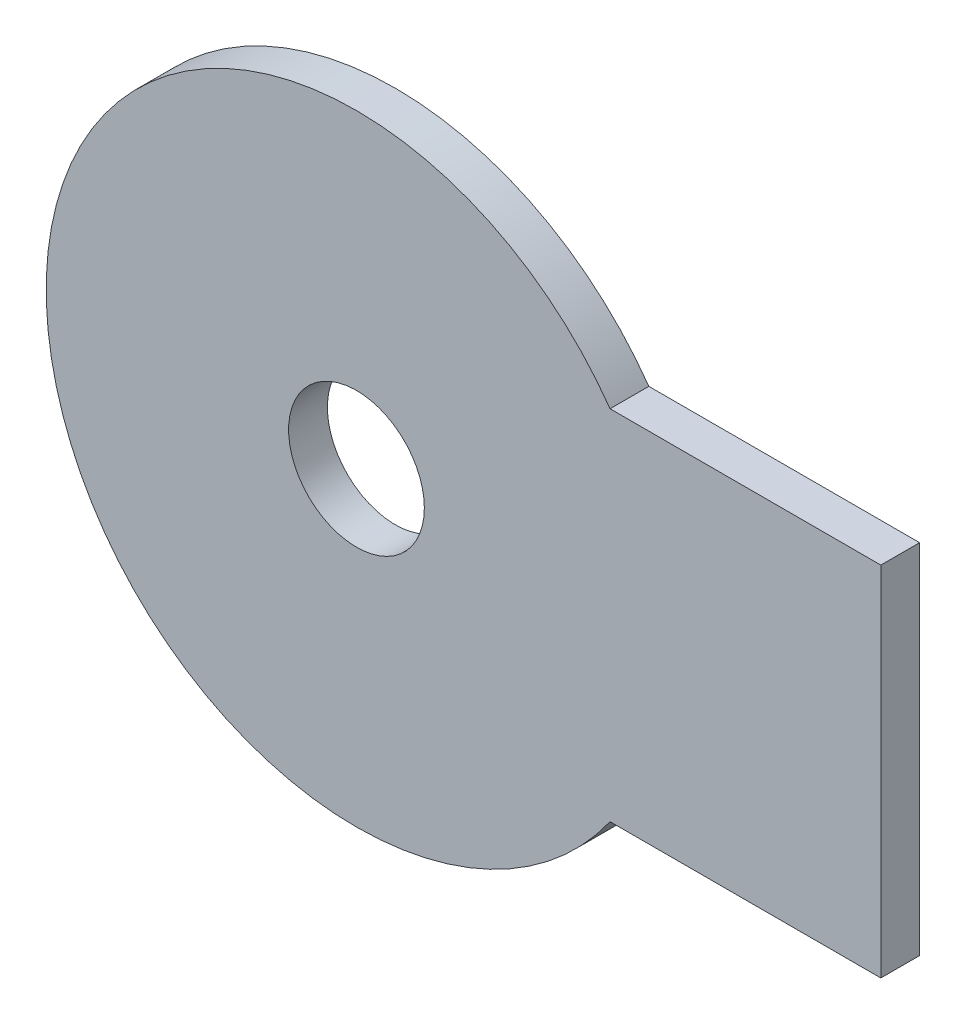
ISO-10303-21;
HEADER;
FILE_DESCRIPTION(('STEP AP214'),'2;1');
FILE_NAME('part.step','',(''),(''),'','','');
FILE_SCHEMA(('AUTOMOTIVE_DESIGN { 1 0 10303 214 1 1 1 1 }'));
ENDSEC;
DATA;
#1=APPLICATION_CONTEXT('core data for automotive mechanical design processes');
#2=APPLICATION_PROTOCOL_DEFINITION('international standard','automotive_design',2000,#1);
#3=PRODUCT_CONTEXT('',#1,'mechanical');
#4=PRODUCT('Part','Part','',(#3));
#5=PRODUCT_RELATED_PRODUCT_CATEGORY('part','',(#4));
#6=PRODUCT_DEFINITION_FORMATION('','',#4);
#7=PRODUCT_DEFINITION_CONTEXT('part definition',#1,'design');
#8=PRODUCT_DEFINITION('design','',#6,#7);
#9=PRODUCT_DEFINITION_SHAPE('','',#8);
#10=(LENGTH_UNIT() NAMED_UNIT(*) SI_UNIT(.MILLI.,.METRE.));
#11=(NAMED_UNIT(*) PLANE_ANGLE_UNIT() SI_UNIT($,.RADIAN.));
#12=(NAMED_UNIT(*) SI_UNIT($,.STERADIAN.) SOLID_ANGLE_UNIT());
#13=UNCERTAINTY_MEASURE_WITH_UNIT(LENGTH_MEASURE(1.E-05),#10,'distance_accuracy_value','');
#14=(GEOMETRIC_REPRESENTATION_CONTEXT(3) GLOBAL_UNCERTAINTY_ASSIGNED_CONTEXT((#13)) GLOBAL_UNIT_ASSIGNED_CONTEXT((#10,
#11,#12)) REPRESENTATION_CONTEXT('',''));
#15=CARTESIAN_POINT('',(0.,0.,0.));
#16=DIRECTION('',(0.,0.,1.));
#17=DIRECTION('',(1.,0.,0.));
#18=AXIS2_PLACEMENT_3D('',#15,#16,#17);
#19=CARTESIAN_POINT('',(0.,0.,12.7));
#20=DIRECTION('',(0.,0.,-1.));
#21=DIRECTION('',(-1.,0.,0.));
#22=AXIS2_PLACEMENT_3D('',#19,#20,#21);
#23=CYLINDRICAL_SURFACE('',#22,101.6);
#24=CARTESIAN_POINT('',(0.,0.,0.));
#25=DIRECTION('',(0.,0.,1.));
#26=DIRECTION('',(1.,0.,0.));
#27=AXIS2_PLACEMENT_3D('',#24,#25,#26);
#28=CIRCLE('',#27,101.6);
#29=CARTESIAN_POINT('',(83.0340445421274,58.5483342801143,0.));
#30=VERTEX_POINT('',#29);
#31=CARTESIAN_POINT('',(83.0340445421274,-58.5483342801143,0.));
#32=VERTEX_POINT('',#31);
#33=EDGE_CURVE('E101',#30,#32,#28,.T.);
#34=ORIENTED_EDGE('',*,*,#33,.T.);
#35=DIRECTION('',(0.,0.,-1.));
#36=VECTOR('',#35,1.);
#37=CARTESIAN_POINT('',(83.0340445421274,-58.5483342801143,12.7));
#38=LINE('',#37,#36);
#39=CARTESIAN_POINT('',(83.0340445421274,-58.5483342801143,12.7));
#40=VERTEX_POINT('',#39);
#41=EDGE_CURVE('E11',#40,#32,#38,.T.);
#42=ORIENTED_EDGE('',*,*,#41,.F.);
#43=CARTESIAN_POINT('',(0.,0.,12.7));
#44=DIRECTION('',(0.,0.,1.));
#45=DIRECTION('',(1.,0.,0.));
#46=AXIS2_PLACEMENT_3D('',#43,#44,#45);
#47=CIRCLE('',#46,101.6);
#48=CARTESIAN_POINT('',(83.0340445421274,58.5483342801143,12.7));
#49=VERTEX_POINT('',#48);
#50=EDGE_CURVE('E75',#49,#40,#47,.T.);
#51=ORIENTED_EDGE('',*,*,#50,.F.);
#52=DIRECTION('',(0.,0.,-1.));
#53=VECTOR('',#52,1.);
#54=CARTESIAN_POINT('',(83.0340445421274,58.5483342801143,12.7));
#55=LINE('',#54,#53);
#56=EDGE_CURVE('E94',#49,#30,#55,.T.);
#57=ORIENTED_EDGE('',*,*,#56,.T.);
#58=EDGE_LOOP('',(#34,#42,#51,#57));
#59=FACE_BOUND('',#58,.T.);
#60=ADVANCED_FACE('F35',(#59),#23,.T.);
#61=CARTESIAN_POINT('',(0.,-58.5483342801143,12.7));
#62=DIRECTION('',(0.,-1.,0.));
#63=DIRECTION('',(0.,0.,-1.));
#64=AXIS2_PLACEMENT_3D('',#61,#62,#63);
#65=PLANE('',#64);
#66=DIRECTION('',(-1.,0.,0.));
#67=VECTOR('',#66,1.);
#68=CARTESIAN_POINT('',(0.,-58.5483342801143,0.));
#69=LINE('',#68,#67);
#70=CARTESIAN_POINT('',(171.693555001292,-58.5483342801143,0.));
#71=VERTEX_POINT('',#70);
#72=EDGE_CURVE('E84',#71,#32,#69,.T.);
#73=ORIENTED_EDGE('',*,*,#72,.F.);
#74=DIRECTION('',(0.,0.,-1.));
#75=VECTOR('',#74,1.);
#76=CARTESIAN_POINT('',(171.693555001292,-58.5483342801143,12.7));
#77=LINE('',#76,#75);
#78=CARTESIAN_POINT('',(171.693555001292,-58.5483342801143,12.7));
#79=VERTEX_POINT('',#78);
#80=EDGE_CURVE('E44',#79,#71,#77,.T.);
#81=ORIENTED_EDGE('',*,*,#80,.F.);
#82=DIRECTION('',(-1.,0.,0.));
#83=VECTOR('',#82,1.);
#84=CARTESIAN_POINT('',(0.,-58.5483342801143,12.7));
#85=LINE('',#84,#83);
#86=EDGE_CURVE('E82',#79,#40,#85,.T.);
#87=ORIENTED_EDGE('',*,*,#86,.T.);
#88=ORIENTED_EDGE('',*,*,#41,.T.);
#89=EDGE_LOOP('',(#73,#81,#87,#88));
#90=FACE_BOUND('',#89,.T.);
#91=ADVANCED_FACE('F81',(#90),#65,.T.);
#92=CARTESIAN_POINT('',(171.693555001292,0.,12.7));
#93=DIRECTION('',(1.,0.,0.));
#94=DIRECTION('',(0.,0.,-1.));
#95=AXIS2_PLACEMENT_3D('',#92,#93,#94);
#96=PLANE('',#95);
#97=DIRECTION('',(0.,-1.,0.));
#98=VECTOR('',#97,1.);
#99=CARTESIAN_POINT('',(171.693555001292,0.,0.));
#100=LINE('',#99,#98);
#101=CARTESIAN_POINT('',(171.693555001292,58.5483342801143,0.));
#102=VERTEX_POINT('',#101);
#103=EDGE_CURVE('E105',#102,#71,#100,.T.);
#104=ORIENTED_EDGE('',*,*,#103,.F.);
#105=DIRECTION('',(0.,0.,-1.));
#106=VECTOR('',#105,1.);
#107=CARTESIAN_POINT('',(171.693555001292,58.5483342801143,12.7));
#108=LINE('',#107,#106);
#109=CARTESIAN_POINT('',(171.693555001292,58.5483342801143,12.7));
#110=VERTEX_POINT('',#109);
#111=EDGE_CURVE('E67',#110,#102,#108,.T.);
#112=ORIENTED_EDGE('',*,*,#111,.F.);
#113=DIRECTION('',(0.,-1.,0.));
#114=VECTOR('',#113,1.);
#115=CARTESIAN_POINT('',(171.693555001292,0.,12.7));
#116=LINE('',#115,#114);
#117=EDGE_CURVE('E90',#110,#79,#116,.T.);
#118=ORIENTED_EDGE('',*,*,#117,.T.);
#119=ORIENTED_EDGE('',*,*,#80,.T.);
#120=EDGE_LOOP('',(#104,#112,#118,#119));
#121=FACE_BOUND('',#120,.T.);
#122=ADVANCED_FACE('F92',(#121),#96,.T.);
#123=CARTESIAN_POINT('',(0.,0.,12.7));
#124=DIRECTION('',(0.,0.,-1.));
#125=DIRECTION('',(-1.,0.,0.));
#126=AXIS2_PLACEMENT_3D('',#123,#124,#125);
#127=CYLINDRICAL_SURFACE('',#126,22.225);
#128=CARTESIAN_POINT('',(0.,0.,12.7));
#129=DIRECTION('',(0.,0.,1.));
#130=DIRECTION('',(1.,0.,0.));
#131=AXIS2_PLACEMENT_3D('',#128,#129,#130);
#132=CIRCLE('',#131,22.225);
#133=CARTESIAN_POINT('',(22.225,0.,12.7));
#134=VERTEX_POINT('',#133);
#135=EDGE_CURVE('E108',#134,#134,#132,.T.);
#136=ORIENTED_EDGE('',*,*,#135,.T.);
#137=EDGE_LOOP('',(#136));
#138=FACE_BOUND('',#137,.T.);
#139=CARTESIAN_POINT('',(0.,0.,0.));
#140=DIRECTION('',(0.,0.,1.));
#141=DIRECTION('',(1.,0.,0.));
#142=AXIS2_PLACEMENT_3D('',#139,#140,#141);
#143=CIRCLE('',#142,22.225);
#144=CARTESIAN_POINT('',(22.225,0.,0.));
#145=VERTEX_POINT('',#144);
#146=EDGE_CURVE('E98',#145,#145,#143,.T.);
#147=ORIENTED_EDGE('',*,*,#146,.F.);
#148=EDGE_LOOP('',(#147));
#149=FACE_BOUND('',#148,.T.);
#150=ADVANCED_FACE('F37',(#138,#149),#127,.F.);
#151=CARTESIAN_POINT('',(0.,58.5483342801143,12.7));
#152=DIRECTION('',(0.,-1.,0.));
#153=DIRECTION('',(1.,0.,0.));
#154=AXIS2_PLACEMENT_3D('',#151,#152,#153);
#155=PLANE('',#154);
#156=DIRECTION('',(-1.,0.,0.));
#157=VECTOR('',#156,1.);
#158=CARTESIAN_POINT('',(0.,58.5483342801143,0.));
#159=LINE('',#158,#157);
#160=EDGE_CURVE('E70',#102,#30,#159,.T.);
#161=ORIENTED_EDGE('',*,*,#160,.T.);
#162=ORIENTED_EDGE('',*,*,#56,.F.);
#163=DIRECTION('',(-1.,0.,0.));
#164=VECTOR('',#163,1.);
#165=CARTESIAN_POINT('',(0.,58.5483342801143,12.7));
#166=LINE('',#165,#164);
#167=EDGE_CURVE('E52',#110,#49,#166,.T.);
#168=ORIENTED_EDGE('',*,*,#167,.F.);
#169=ORIENTED_EDGE('',*,*,#111,.T.);
#170=EDGE_LOOP('',(#161,#162,#168,#169));
#171=FACE_BOUND('',#170,.T.);
#172=ADVANCED_FACE('F120',(#171),#155,.F.);
#173=CARTESIAN_POINT('',(0.,0.,12.7));
#174=DIRECTION('',(0.,0.,1.));
#175=DIRECTION('',(1.,0.,0.));
#176=AXIS2_PLACEMENT_3D('',#173,#174,#175);
#177=PLANE('',#176);
#178=ORIENTED_EDGE('',*,*,#135,.F.);
#179=EDGE_LOOP('',(#178));
#180=FACE_BOUND('',#179,.T.);
#181=ORIENTED_EDGE('',*,*,#50,.T.);
#182=ORIENTED_EDGE('',*,*,#86,.F.);
#183=ORIENTED_EDGE('',*,*,#117,.F.);
#184=ORIENTED_EDGE('',*,*,#167,.T.);
#185=EDGE_LOOP('',(#181,#182,#183,#184));
#186=FACE_BOUND('',#185,.T.);
#187=ADVANCED_FACE('F89',(#180,#186),#177,.T.);
#188=CARTESIAN_POINT('',(0.,0.,0.));
#189=DIRECTION('',(0.,0.,1.));
#190=DIRECTION('',(1.,0.,0.));
#191=AXIS2_PLACEMENT_3D('',#188,#189,#190);
#192=PLANE('',#191);
#193=ORIENTED_EDGE('',*,*,#146,.T.);
#194=EDGE_LOOP('',(#193));
#195=FACE_BOUND('',#194,.T.);
#196=ORIENTED_EDGE('',*,*,#33,.F.);
#197=ORIENTED_EDGE('',*,*,#160,.F.);
#198=ORIENTED_EDGE('',*,*,#103,.T.);
#199=ORIENTED_EDGE('',*,*,#72,.T.);
#200=EDGE_LOOP('',(#196,#197,#198,#199));
#201=FACE_BOUND('',#200,.T.);
#202=ADVANCED_FACE('F113',(#195,#201),#192,.F.);
#203=CLOSED_SHELL('',(#60,#91,#122,#150,#172,#187,#202));
#204=MANIFOLD_SOLID_BREP('B2',#203);
#205=ADVANCED_BREP_SHAPE_REPRESENTATION('',(#18,#204),#14);
#206=SHAPE_DEFINITION_REPRESENTATION(#9,#205);
ENDSEC;
END-ISO-10303-21;
